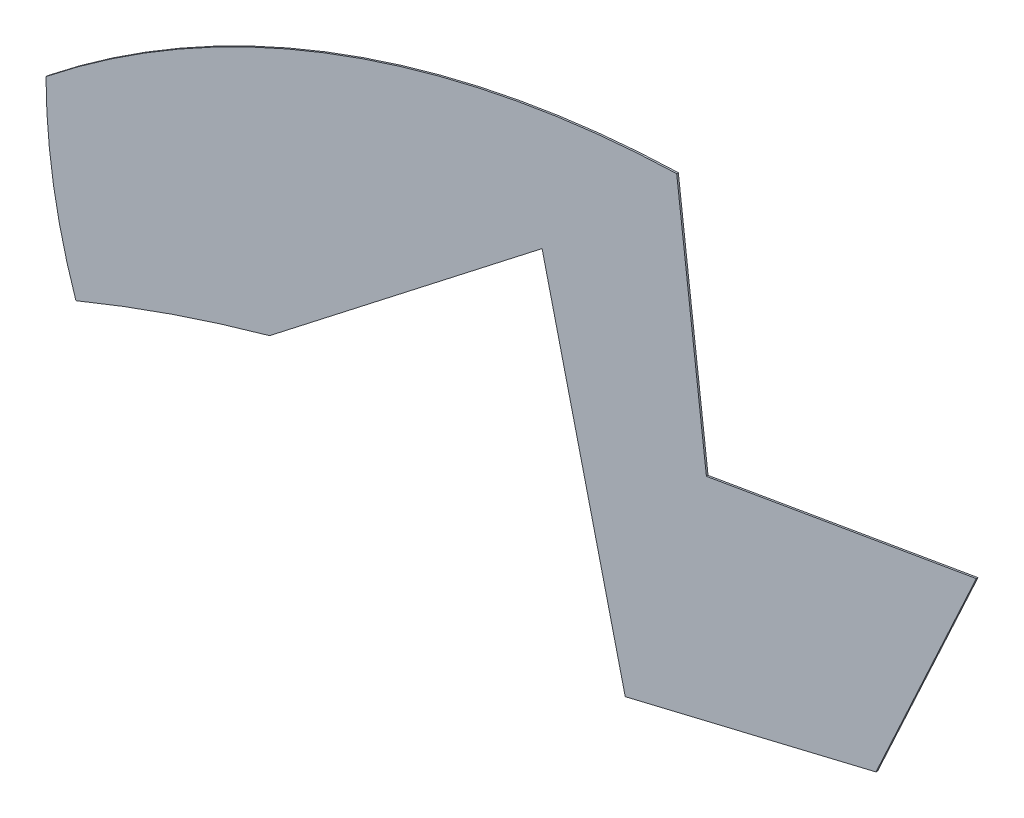
ISO-10303-21;
HEADER;
FILE_DESCRIPTION(('STEP AP214'),'2;1');
FILE_NAME('part.step','',(''),(''),'','','');
FILE_SCHEMA(('AUTOMOTIVE_DESIGN { 1 0 10303 214 1 1 1 1 }'));
ENDSEC;
DATA;
#1=APPLICATION_CONTEXT('core data for automotive mechanical design processes');
#2=APPLICATION_PROTOCOL_DEFINITION('international standard','automotive_design',2000,#1);
#3=PRODUCT_CONTEXT('',#1,'mechanical');
#4=PRODUCT('Part','Part','',(#3));
#5=PRODUCT_RELATED_PRODUCT_CATEGORY('part','',(#4));
#6=PRODUCT_DEFINITION_FORMATION('','',#4);
#7=PRODUCT_DEFINITION_CONTEXT('part definition',#1,'design');
#8=PRODUCT_DEFINITION('design','',#6,#7);
#9=PRODUCT_DEFINITION_SHAPE('','',#8);
#10=(LENGTH_UNIT() NAMED_UNIT(*) SI_UNIT(.MILLI.,.METRE.));
#11=(NAMED_UNIT(*) PLANE_ANGLE_UNIT() SI_UNIT($,.RADIAN.));
#12=(NAMED_UNIT(*) SI_UNIT($,.STERADIAN.) SOLID_ANGLE_UNIT());
#13=UNCERTAINTY_MEASURE_WITH_UNIT(LENGTH_MEASURE(1.E-05),#10,'distance_accuracy_value','');
#14=(GEOMETRIC_REPRESENTATION_CONTEXT(3) GLOBAL_UNCERTAINTY_ASSIGNED_CONTEXT((#13)) GLOBAL_UNIT_ASSIGNED_CONTEXT((#10,
#11,#12)) REPRESENTATION_CONTEXT('',''));
#15=CARTESIAN_POINT('',(0.,0.,0.));
#16=DIRECTION('',(0.,0.,1.));
#17=DIRECTION('',(1.,0.,0.));
#18=AXIS2_PLACEMENT_3D('',#15,#16,#17);
#19=CARTESIAN_POINT('',(29.7131628772955,-25.3143678043269,0.1));
#20=DIRECTION('',(0.,0.,-1.));
#21=DIRECTION('',(-1.,0.,0.));
#22=AXIS2_PLACEMENT_3D('',#19,#20,#21);
#23=CYLINDRICAL_SURFACE('',#22,64.8731226921538);
#24=CARTESIAN_POINT('',(29.7131628772955,-25.3143678043269,0.));
#25=DIRECTION('',(0.,0.,1.));
#26=DIRECTION('',(1.,0.,0.));
#27=AXIS2_PLACEMENT_3D('',#24,#25,#26);
#28=CIRCLE('',#27,64.8731226921538);
#29=CARTESIAN_POINT('',(27.703067566427,39.5276059832782,0.));
#30=VERTEX_POINT('',#29);
#31=CARTESIAN_POINT('',(-10.6739269143685,25.4537819156631,0.));
#32=VERTEX_POINT('',#31);
#33=EDGE_CURVE('E135',#30,#32,#28,.T.);
#34=ORIENTED_EDGE('',*,*,#33,.T.);
#35=DIRECTION('',(0.,0.,-1.));
#36=VECTOR('',#35,1.);
#37=CARTESIAN_POINT('',(-10.6739269143685,25.4537819156631,0.1));
#38=LINE('',#37,#36);
#39=CARTESIAN_POINT('',(-10.6739269143685,25.4537819156631,0.1));
#40=VERTEX_POINT('',#39);
#41=EDGE_CURVE('E11',#40,#32,#38,.T.);
#42=ORIENTED_EDGE('',*,*,#41,.F.);
#43=CARTESIAN_POINT('',(29.7131628772955,-25.3143678043269,0.1));
#44=DIRECTION('',(0.,0.,1.));
#45=DIRECTION('',(1.,0.,0.));
#46=AXIS2_PLACEMENT_3D('',#43,#44,#45);
#47=CIRCLE('',#46,64.8731226921538);
#48=CARTESIAN_POINT('',(27.703067566427,39.5276059832782,0.1));
#49=VERTEX_POINT('',#48);
#50=EDGE_CURVE('E151',#49,#40,#47,.T.);
#51=ORIENTED_EDGE('',*,*,#50,.F.);
#52=DIRECTION('',(0.,0.,-1.));
#53=VECTOR('',#52,1.);
#54=CARTESIAN_POINT('',(27.703067566427,39.5276059832782,0.1));
#55=LINE('',#54,#53);
#56=EDGE_CURVE('E131',#49,#30,#55,.T.);
#57=ORIENTED_EDGE('',*,*,#56,.T.);
#58=EDGE_LOOP('',(#34,#42,#51,#57));
#59=FACE_BOUND('',#58,.T.);
#60=ADVANCED_FACE('F33',(#59),#23,.T.);
#61=CARTESIAN_POINT('',(23.1618227330117,25.499355702288,0.1));
#62=DIRECTION('',(0.,0.,-1.));
#63=DIRECTION('',(-1.,0.,0.));
#64=AXIS2_PLACEMENT_3D('',#61,#62,#63);
#65=CYLINDRICAL_SURFACE('',#64,33.8357803393127);
#66=CARTESIAN_POINT('',(23.1618227330117,25.499355702288,0.));
#67=DIRECTION('',(0.,0.,1.));
#68=DIRECTION('',(1.,0.,0.));
#69=AXIS2_PLACEMENT_3D('',#66,#67,#68);
#70=CIRCLE('',#69,33.8357803393127);
#71=CARTESIAN_POINT('',(-8.85422266202399,14.5525356876339,0.));
#72=VERTEX_POINT('',#71);
#73=EDGE_CURVE('E138',#32,#72,#70,.T.);
#74=ORIENTED_EDGE('',*,*,#73,.T.);
#75=DIRECTION('',(0.,0.,-1.));
#76=VECTOR('',#75,1.);
#77=CARTESIAN_POINT('',(-8.85422266202399,14.5525356876339,0.1));
#78=LINE('',#77,#76);
#79=CARTESIAN_POINT('',(-8.85422266202399,14.5525356876339,0.1));
#80=VERTEX_POINT('',#79);
#81=EDGE_CURVE('E41',#80,#72,#78,.T.);
#82=ORIENTED_EDGE('',*,*,#81,.F.);
#83=CARTESIAN_POINT('',(23.1618227330117,25.499355702288,0.1));
#84=DIRECTION('',(0.,0.,1.));
#85=DIRECTION('',(1.,0.,0.));
#86=AXIS2_PLACEMENT_3D('',#83,#84,#85);
#87=CIRCLE('',#86,33.8357803393127);
#88=EDGE_CURVE('E95',#40,#80,#87,.T.);
#89=ORIENTED_EDGE('',*,*,#88,.F.);
#90=ORIENTED_EDGE('',*,*,#41,.T.);
#91=EDGE_LOOP('',(#74,#82,#89,#90));
#92=FACE_BOUND('',#91,.T.);
#93=ADVANCED_FACE('F194',(#92),#65,.T.);
#94=CARTESIAN_POINT('',(30.7068916071296,-81.4038849932268,0.1));
#95=DIRECTION('',(0.,0.,-1.));
#96=DIRECTION('',(-1.,0.,0.));
#97=AXIS2_PLACEMENT_3D('',#94,#95,#96);
#98=CYLINDRICAL_SURFACE('',#97,103.79169731775);
#99=CARTESIAN_POINT('',(30.7068916071296,-81.4038849932268,0.));
#100=DIRECTION('',(0.,0.,-1.));
#101=DIRECTION('',(1.,0.,0.));
#102=AXIS2_PLACEMENT_3D('',#99,#100,#101);
#103=CIRCLE('',#102,103.79169731775);
#104=CARTESIAN_POINT('',(2.9336057529605,18.6029199000501,0.));
#105=VERTEX_POINT('',#104);
#106=EDGE_CURVE('E140',#72,#105,#103,.T.);
#107=ORIENTED_EDGE('',*,*,#106,.T.);
#108=DIRECTION('',(0.,0.,-1.));
#109=VECTOR('',#108,1.);
#110=CARTESIAN_POINT('',(2.9336057529605,18.6029199000501,0.1));
#111=LINE('',#110,#109);
#112=CARTESIAN_POINT('',(2.9336057529605,18.6029199000501,0.1));
#113=VERTEX_POINT('',#112);
#114=EDGE_CURVE('E161',#113,#105,#111,.T.);
#115=ORIENTED_EDGE('',*,*,#114,.F.);
#116=CARTESIAN_POINT('',(30.7068916071296,-81.4038849932268,0.1));
#117=DIRECTION('',(0.,0.,-1.));
#118=DIRECTION('',(1.,0.,0.));
#119=AXIS2_PLACEMENT_3D('',#116,#117,#118);
#120=CIRCLE('',#119,103.79169731775);
#121=EDGE_CURVE('E169',#80,#113,#120,.T.);
#122=ORIENTED_EDGE('',*,*,#121,.F.);
#123=ORIENTED_EDGE('',*,*,#81,.T.);
#124=EDGE_LOOP('',(#107,#115,#122,#123));
#125=FACE_BOUND('',#124,.T.);
#126=ADVANCED_FACE('F167',(#125),#98,.F.);
#127=CARTESIAN_POINT('',(2.9336057529605,18.6029199000501,0.1));
#128=DIRECTION('',(-0.613427369069024,0.789751139839035,0.));
#129=DIRECTION('',(-0.789751139839035,-0.613427369069024,0.));
#130=AXIS2_PLACEMENT_3D('',#127,#128,#129);
#131=PLANE('',#130);
#132=DIRECTION('',(0.789751139839035,0.613427369069024,0.));
#133=VECTOR('',#132,1.);
#134=CARTESIAN_POINT('',(2.9336057529605,18.6029199000501,0.));
#135=LINE('',#134,#133);
#136=CARTESIAN_POINT('',(19.5125853921047,31.4803940167218,0.));
#137=VERTEX_POINT('',#136);
#138=EDGE_CURVE('E142',#105,#137,#135,.T.);
#139=ORIENTED_EDGE('',*,*,#138,.T.);
#140=DIRECTION('',(0.,0.,-1.));
#141=VECTOR('',#140,1.);
#142=CARTESIAN_POINT('',(19.5125853921047,31.4803940167218,0.1));
#143=LINE('',#142,#141);
#144=CARTESIAN_POINT('',(19.5125853921047,31.4803940167218,0.1));
#145=VERTEX_POINT('',#144);
#146=EDGE_CURVE('E158',#145,#137,#143,.T.);
#147=ORIENTED_EDGE('',*,*,#146,.F.);
#148=DIRECTION('',(0.789751139839035,0.613427369069024,0.));
#149=VECTOR('',#148,1.);
#150=CARTESIAN_POINT('',(2.9336057529605,18.6029199000501,0.1));
#151=LINE('',#150,#149);
#152=EDGE_CURVE('E185',#113,#145,#151,.T.);
#153=ORIENTED_EDGE('',*,*,#152,.F.);
#154=ORIENTED_EDGE('',*,*,#114,.T.);
#155=EDGE_LOOP('',(#139,#147,#153,#154));
#156=FACE_BOUND('',#155,.T.);
#157=ADVANCED_FACE('F178',(#156),#131,.F.);
#158=CARTESIAN_POINT('',(19.5125853921047,31.4803940167218,0.1));
#159=DIRECTION('',(0.972375979097609,0.233420126111626,0.));
#160=DIRECTION('',(-0.233420126111626,0.972375979097608,0.));
#161=AXIS2_PLACEMENT_3D('',#158,#159,#160);
#162=PLANE('',#161);
#163=DIRECTION('',(0.233420126111626,-0.972375979097609,0.));
#164=VECTOR('',#163,1.);
#165=CARTESIAN_POINT('',(19.5125853921047,31.4803940167218,0.));
#166=LINE('',#165,#164);
#167=CARTESIAN_POINT('',(24.5734925948328,10.3977878235372,0.));
#168=VERTEX_POINT('',#167);
#169=EDGE_CURVE('E144',#137,#168,#166,.T.);
#170=ORIENTED_EDGE('',*,*,#169,.T.);
#171=DIRECTION('',(0.,0.,-1.));
#172=VECTOR('',#171,1.);
#173=CARTESIAN_POINT('',(24.5734925948328,10.3977878235372,0.1));
#174=LINE('',#173,#172);
#175=CARTESIAN_POINT('',(24.5734925948328,10.3977878235372,0.1));
#176=VERTEX_POINT('',#175);
#177=EDGE_CURVE('E155',#176,#168,#174,.T.);
#178=ORIENTED_EDGE('',*,*,#177,.F.);
#179=DIRECTION('',(0.233420126111626,-0.972375979097609,0.));
#180=VECTOR('',#179,1.);
#181=CARTESIAN_POINT('',(19.5125853921047,31.4803940167218,0.1));
#182=LINE('',#181,#180);
#183=EDGE_CURVE('E184',#145,#176,#182,.T.);
#184=ORIENTED_EDGE('',*,*,#183,.F.);
#185=ORIENTED_EDGE('',*,*,#146,.T.);
#186=EDGE_LOOP('',(#170,#178,#184,#185));
#187=FACE_BOUND('',#186,.T.);
#188=ADVANCED_FACE('F182',(#187),#162,.F.);
#189=CARTESIAN_POINT('',(39.8319188868193,14.0605930201914,0.1));
#190=DIRECTION('',(-0.233420126111626,0.972375979097608,0.));
#191=DIRECTION('',(-0.972375979097608,-0.233420126111626,0.));
#192=AXIS2_PLACEMENT_3D('',#189,#190,#191);
#193=PLANE('',#192);
#194=DIRECTION('',(0.972375979097608,0.233420126111626,0.));
#195=VECTOR('',#194,1.);
#196=CARTESIAN_POINT('',(39.8319188868193,14.0605930201914,0.));
#197=LINE('',#196,#195);
#198=CARTESIAN_POINT('',(39.8319188868193,14.0605930201914,0.));
#199=VERTEX_POINT('',#198);
#200=EDGE_CURVE('E146',#168,#199,#197,.T.);
#201=ORIENTED_EDGE('',*,*,#200,.T.);
#202=DIRECTION('',(0.,0.,-1.));
#203=VECTOR('',#202,1.);
#204=CARTESIAN_POINT('',(39.8319188868193,14.0605930201914,0.1));
#205=LINE('',#204,#203);
#206=CARTESIAN_POINT('',(39.8319188868193,14.0605930201914,0.1));
#207=VERTEX_POINT('',#206);
#208=EDGE_CURVE('E126',#207,#199,#205,.T.);
#209=ORIENTED_EDGE('',*,*,#208,.F.);
#210=DIRECTION('',(0.972375979097608,0.233420126111626,0.));
#211=VECTOR('',#210,1.);
#212=CARTESIAN_POINT('',(39.8319188868193,14.0605930201914,0.1));
#213=LINE('',#212,#211);
#214=EDGE_CURVE('E117',#176,#207,#213,.T.);
#215=ORIENTED_EDGE('',*,*,#214,.F.);
#216=ORIENTED_EDGE('',*,*,#177,.T.);
#217=EDGE_LOOP('',(#201,#209,#215,#216));
#218=FACE_BOUND('',#217,.T.);
#219=ADVANCED_FACE('F206',(#218),#193,.F.);
#220=CARTESIAN_POINT('',(39.8319188868193,14.0605930201914,0.1));
#221=DIRECTION('',(-0.908106046900274,0.418740262672648,0.));
#222=DIRECTION('',(-0.418740262672648,-0.908106046900274,0.));
#223=AXIS2_PLACEMENT_3D('',#220,#221,#222);
#224=PLANE('',#223);
#225=DIRECTION('',(0.418740262672648,0.908106046900274,0.));
#226=VECTOR('',#225,1.);
#227=CARTESIAN_POINT('',(39.8319188868193,14.0605930201914,0.));
#228=LINE('',#227,#226);
#229=CARTESIAN_POINT('',(45.9388819909911,27.3045311304149,0.));
#230=VERTEX_POINT('',#229);
#231=EDGE_CURVE('E125',#199,#230,#228,.T.);
#232=ORIENTED_EDGE('',*,*,#231,.T.);
#233=DIRECTION('',(0.,0.,-1.));
#234=VECTOR('',#233,1.);
#235=CARTESIAN_POINT('',(45.9388819909911,27.3045311304149,0.1));
#236=LINE('',#235,#234);
#237=CARTESIAN_POINT('',(45.9388819909911,27.3045311304149,0.1));
#238=VERTEX_POINT('',#237);
#239=EDGE_CURVE('E122',#238,#230,#236,.T.);
#240=ORIENTED_EDGE('',*,*,#239,.F.);
#241=DIRECTION('',(0.418740262672648,0.908106046900274,0.));
#242=VECTOR('',#241,1.);
#243=CARTESIAN_POINT('',(39.8319188868193,14.0605930201914,0.1));
#244=LINE('',#243,#242);
#245=EDGE_CURVE('E111',#207,#238,#244,.T.);
#246=ORIENTED_EDGE('',*,*,#245,.F.);
#247=ORIENTED_EDGE('',*,*,#208,.T.);
#248=EDGE_LOOP('',(#232,#240,#246,#247));
#249=FACE_BOUND('',#248,.T.);
#250=ADVANCED_FACE('F123',(#249),#224,.F.);
#251=CARTESIAN_POINT('',(45.9388819909911,27.3045311304149,0.1));
#252=DIRECTION('',(0.169441763299948,-0.985540201539138,0.));
#253=DIRECTION('',(0.985540201539138,0.169441763299948,0.));
#254=AXIS2_PLACEMENT_3D('',#251,#252,#253);
#255=PLANE('',#254);
#256=DIRECTION('',(-0.985540201539138,-0.169441763299948,0.));
#257=VECTOR('',#256,1.);
#258=CARTESIAN_POINT('',(45.9388819909911,27.3045311304149,0.));
#259=LINE('',#258,#257);
#260=CARTESIAN_POINT('',(29.5125853921047,24.4803940167218,0.));
#261=VERTEX_POINT('',#260);
#262=EDGE_CURVE('E81',#230,#261,#259,.T.);
#263=ORIENTED_EDGE('',*,*,#262,.T.);
#264=DIRECTION('',(0.,0.,-1.));
#265=VECTOR('',#264,1.);
#266=CARTESIAN_POINT('',(29.5125853921047,24.4803940167218,0.1));
#267=LINE('',#266,#265);
#268=CARTESIAN_POINT('',(29.5125853921047,24.4803940167218,0.1));
#269=VERTEX_POINT('',#268);
#270=EDGE_CURVE('E127',#269,#261,#267,.T.);
#271=ORIENTED_EDGE('',*,*,#270,.F.);
#272=DIRECTION('',(-0.985540201539138,-0.169441763299948,0.));
#273=VECTOR('',#272,1.);
#274=CARTESIAN_POINT('',(45.9388819909911,27.3045311304149,0.1));
#275=LINE('',#274,#273);
#276=EDGE_CURVE('E115',#238,#269,#275,.T.);
#277=ORIENTED_EDGE('',*,*,#276,.F.);
#278=ORIENTED_EDGE('',*,*,#239,.T.);
#279=EDGE_LOOP('',(#263,#271,#277,#278));
#280=FACE_BOUND('',#279,.T.);
#281=ADVANCED_FACE('F129',(#280),#255,.F.);
#282=CARTESIAN_POINT('',(29.5125853921047,24.4803940167218,0.1));
#283=DIRECTION('',(-0.992846737215125,-0.119395797251328,0.));
#284=DIRECTION('',(0.119395797251328,-0.992846737215125,0.));
#285=AXIS2_PLACEMENT_3D('',#282,#283,#284);
#286=PLANE('',#285);
#287=DIRECTION('',(-0.119395797251328,0.992846737215125,0.));
#288=VECTOR('',#287,1.);
#289=CARTESIAN_POINT('',(29.5125853921047,24.4803940167218,0.));
#290=LINE('',#289,#288);
#291=EDGE_CURVE('E87',#261,#30,#290,.T.);
#292=ORIENTED_EDGE('',*,*,#291,.T.);
#293=ORIENTED_EDGE('',*,*,#56,.F.);
#294=DIRECTION('',(-0.119395797251328,0.992846737215125,0.));
#295=VECTOR('',#294,1.);
#296=CARTESIAN_POINT('',(29.5125853921047,24.4803940167218,0.1));
#297=LINE('',#296,#295);
#298=EDGE_CURVE('E49',#269,#49,#297,.T.);
#299=ORIENTED_EDGE('',*,*,#298,.F.);
#300=ORIENTED_EDGE('',*,*,#270,.T.);
#301=EDGE_LOOP('',(#292,#293,#299,#300));
#302=FACE_BOUND('',#301,.T.);
#303=ADVANCED_FACE('F214',(#302),#286,.F.);
#304=CARTESIAN_POINT('',(29.7131628772955,-25.3143678043269,0.1));
#305=DIRECTION('',(0.,0.,1.));
#306=DIRECTION('',(1.,0.,0.));
#307=AXIS2_PLACEMENT_3D('',#304,#305,#306);
#308=PLANE('',#307);
#309=ORIENTED_EDGE('',*,*,#50,.T.);
#310=ORIENTED_EDGE('',*,*,#88,.T.);
#311=ORIENTED_EDGE('',*,*,#121,.T.);
#312=ORIENTED_EDGE('',*,*,#152,.T.);
#313=ORIENTED_EDGE('',*,*,#183,.T.);
#314=ORIENTED_EDGE('',*,*,#214,.T.);
#315=ORIENTED_EDGE('',*,*,#245,.T.);
#316=ORIENTED_EDGE('',*,*,#276,.T.);
#317=ORIENTED_EDGE('',*,*,#298,.T.);
#318=EDGE_LOOP('',(#309,#310,#311,#312,#313,#314,#315,#316,#317));
#319=FACE_BOUND('',#318,.T.);
#320=ADVANCED_FACE('F113',(#319),#308,.T.);
#321=CARTESIAN_POINT('',(29.7131628772955,-25.3143678043269,0.));
#322=DIRECTION('',(0.,0.,1.));
#323=DIRECTION('',(1.,0.,0.));
#324=AXIS2_PLACEMENT_3D('',#321,#322,#323);
#325=PLANE('',#324);
#326=ORIENTED_EDGE('',*,*,#33,.F.);
#327=ORIENTED_EDGE('',*,*,#291,.F.);
#328=ORIENTED_EDGE('',*,*,#262,.F.);
#329=ORIENTED_EDGE('',*,*,#231,.F.);
#330=ORIENTED_EDGE('',*,*,#200,.F.);
#331=ORIENTED_EDGE('',*,*,#169,.F.);
#332=ORIENTED_EDGE('',*,*,#138,.F.);
#333=ORIENTED_EDGE('',*,*,#106,.F.);
#334=ORIENTED_EDGE('',*,*,#73,.F.);
#335=EDGE_LOOP('',(#326,#327,#328,#329,#330,#331,#332,#333,#334));
#336=FACE_BOUND('',#335,.T.);
#337=ADVANCED_FACE('F173',(#336),#325,.F.);
#338=CLOSED_SHELL('',(#60,#93,#126,#157,#188,#219,#250,#281,#303,#320,#337));
#339=MANIFOLD_SOLID_BREP('B2',#338);
#340=ADVANCED_BREP_SHAPE_REPRESENTATION('',(#18,#339),#14);
#341=SHAPE_DEFINITION_REPRESENTATION(#9,#340);
ENDSEC;
END-ISO-10303-21;
